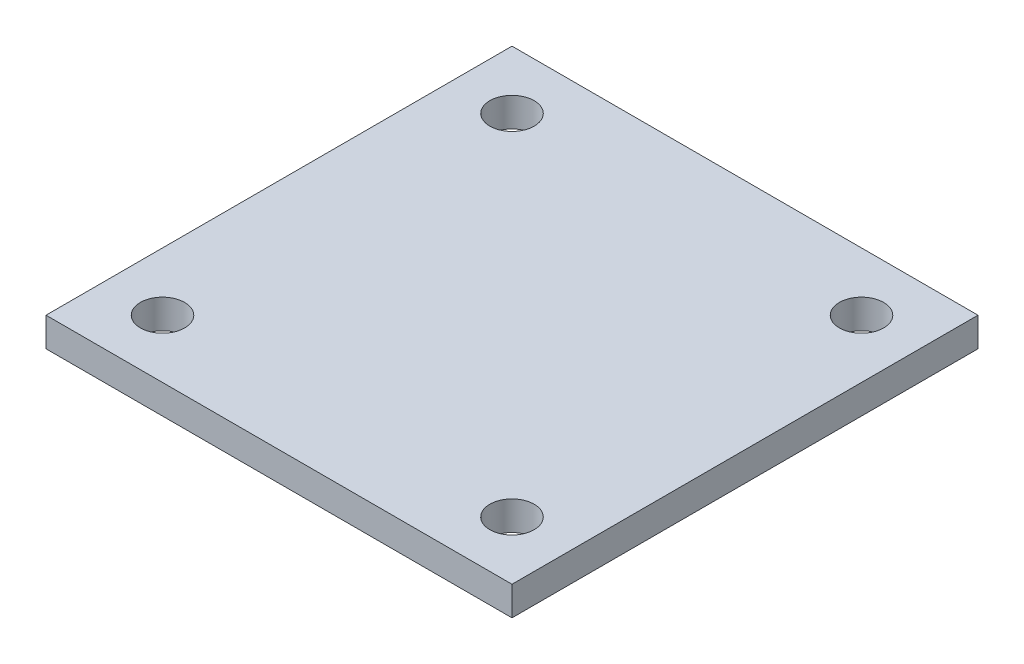
ISO-10303-21;
HEADER;
FILE_DESCRIPTION(('STEP AP214'),'2;1');
FILE_NAME('part.step','',(''),(''),'','','');
FILE_SCHEMA(('AUTOMOTIVE_DESIGN { 1 0 10303 214 1 1 1 1 }'));
ENDSEC;
DATA;
#1=APPLICATION_CONTEXT('core data for automotive mechanical design processes');
#2=APPLICATION_PROTOCOL_DEFINITION('international standard','automotive_design',2000,#1);
#3=PRODUCT_CONTEXT('',#1,'mechanical');
#4=PRODUCT('Part','Part','',(#3));
#5=PRODUCT_RELATED_PRODUCT_CATEGORY('part','',(#4));
#6=PRODUCT_DEFINITION_FORMATION('','',#4);
#7=PRODUCT_DEFINITION_CONTEXT('part definition',#1,'design');
#8=PRODUCT_DEFINITION('design','',#6,#7);
#9=PRODUCT_DEFINITION_SHAPE('','',#8);
#10=(LENGTH_UNIT() NAMED_UNIT(*) SI_UNIT(.MILLI.,.METRE.));
#11=(NAMED_UNIT(*) PLANE_ANGLE_UNIT() SI_UNIT($,.RADIAN.));
#12=(NAMED_UNIT(*) SI_UNIT($,.STERADIAN.) SOLID_ANGLE_UNIT());
#13=UNCERTAINTY_MEASURE_WITH_UNIT(LENGTH_MEASURE(1.E-05),#10,'distance_accuracy_value','');
#14=(GEOMETRIC_REPRESENTATION_CONTEXT(3) GLOBAL_UNCERTAINTY_ASSIGNED_CONTEXT((#13)) GLOBAL_UNIT_ASSIGNED_CONTEXT((#10,
#11,#12)) REPRESENTATION_CONTEXT('',''));
#15=CARTESIAN_POINT('',(0.,0.,0.));
#16=DIRECTION('',(0.,0.,1.));
#17=DIRECTION('',(1.,0.,0.));
#18=AXIS2_PLACEMENT_3D('',#15,#16,#17);
#19=CARTESIAN_POINT('',(-50.8,6.35,-50.8));
#20=DIRECTION('',(1.,0.,0.));
#21=DIRECTION('',(0.,0.,-1.));
#22=AXIS2_PLACEMENT_3D('',#19,#20,#21);
#23=PLANE('',#22);
#24=DIRECTION('',(0.,0.,1.));
#25=VECTOR('',#24,1.);
#26=CARTESIAN_POINT('',(-50.8,0.,-50.8));
#27=LINE('',#26,#25);
#28=CARTESIAN_POINT('',(-50.8,0.,-50.8));
#29=VERTEX_POINT('',#28);
#30=CARTESIAN_POINT('',(-50.8,0.,50.8));
#31=VERTEX_POINT('',#30);
#32=EDGE_CURVE('E107',#29,#31,#27,.T.);
#33=ORIENTED_EDGE('',*,*,#32,.T.);
#34=DIRECTION('',(0.,-1.,0.));
#35=VECTOR('',#34,1.);
#36=CARTESIAN_POINT('',(-50.8,6.35,50.8));
#37=LINE('',#36,#35);
#38=CARTESIAN_POINT('',(-50.8,6.35,50.8));
#39=VERTEX_POINT('',#38);
#40=EDGE_CURVE('E11',#39,#31,#37,.T.);
#41=ORIENTED_EDGE('',*,*,#40,.F.);
#42=DIRECTION('',(0.,0.,1.));
#43=VECTOR('',#42,1.);
#44=CARTESIAN_POINT('',(-50.8,6.35,-50.8));
#45=LINE('',#44,#43);
#46=CARTESIAN_POINT('',(-50.8,6.35,-50.8));
#47=VERTEX_POINT('',#46);
#48=EDGE_CURVE('E91',#47,#39,#45,.T.);
#49=ORIENTED_EDGE('',*,*,#48,.F.);
#50=DIRECTION('',(0.,-1.,0.));
#51=VECTOR('',#50,1.);
#52=CARTESIAN_POINT('',(-50.8,6.35,-50.8));
#53=LINE('',#52,#51);
#54=EDGE_CURVE('E103',#47,#29,#53,.T.);
#55=ORIENTED_EDGE('',*,*,#54,.T.);
#56=EDGE_LOOP('',(#33,#41,#49,#55));
#57=FACE_BOUND('',#56,.T.);
#58=ADVANCED_FACE('F39',(#57),#23,.F.);
#59=CARTESIAN_POINT('',(50.8,6.35,50.8));
#60=DIRECTION('',(0.,0.,-1.));
#61=DIRECTION('',(-1.,0.,0.));
#62=AXIS2_PLACEMENT_3D('',#59,#60,#61);
#63=PLANE('',#62);
#64=DIRECTION('',(1.,0.,0.));
#65=VECTOR('',#64,1.);
#66=CARTESIAN_POINT('',(50.8,0.,50.8));
#67=LINE('',#66,#65);
#68=CARTESIAN_POINT('',(50.8,0.,50.8));
#69=VERTEX_POINT('',#68);
#70=EDGE_CURVE('E96',#31,#69,#67,.T.);
#71=ORIENTED_EDGE('',*,*,#70,.T.);
#72=DIRECTION('',(0.,-1.,0.));
#73=VECTOR('',#72,1.);
#74=CARTESIAN_POINT('',(50.8,6.35,50.8));
#75=LINE('',#74,#73);
#76=CARTESIAN_POINT('',(50.8,6.35,50.8));
#77=VERTEX_POINT('',#76);
#78=EDGE_CURVE('E48',#77,#69,#75,.T.);
#79=ORIENTED_EDGE('',*,*,#78,.F.);
#80=DIRECTION('',(1.,0.,0.));
#81=VECTOR('',#80,1.);
#82=CARTESIAN_POINT('',(50.8,6.35,50.8));
#83=LINE('',#82,#81);
#84=EDGE_CURVE('E86',#39,#77,#83,.T.);
#85=ORIENTED_EDGE('',*,*,#84,.F.);
#86=ORIENTED_EDGE('',*,*,#40,.T.);
#87=EDGE_LOOP('',(#71,#79,#85,#86));
#88=FACE_BOUND('',#87,.T.);
#89=ADVANCED_FACE('F95',(#88),#63,.F.);
#90=CARTESIAN_POINT('',(50.8,6.35,-50.8));
#91=DIRECTION('',(-1.,0.,0.));
#92=DIRECTION('',(0.,0.,1.));
#93=AXIS2_PLACEMENT_3D('',#90,#91,#92);
#94=PLANE('',#93);
#95=DIRECTION('',(0.,0.,-1.));
#96=VECTOR('',#95,1.);
#97=CARTESIAN_POINT('',(50.8,0.,-50.8));
#98=LINE('',#97,#96);
#99=CARTESIAN_POINT('',(50.8,0.,-50.8));
#100=VERTEX_POINT('',#99);
#101=EDGE_CURVE('E73',#69,#100,#98,.T.);
#102=ORIENTED_EDGE('',*,*,#101,.T.);
#103=DIRECTION('',(0.,-1.,0.));
#104=VECTOR('',#103,1.);
#105=CARTESIAN_POINT('',(50.8,6.35,-50.8));
#106=LINE('',#105,#104);
#107=CARTESIAN_POINT('',(50.8,6.35,-50.8));
#108=VERTEX_POINT('',#107);
#109=EDGE_CURVE('E98',#108,#100,#106,.T.);
#110=ORIENTED_EDGE('',*,*,#109,.F.);
#111=DIRECTION('',(0.,0.,-1.));
#112=VECTOR('',#111,1.);
#113=CARTESIAN_POINT('',(50.8,6.35,-50.8));
#114=LINE('',#113,#112);
#115=EDGE_CURVE('E89',#77,#108,#114,.T.);
#116=ORIENTED_EDGE('',*,*,#115,.F.);
#117=ORIENTED_EDGE('',*,*,#78,.T.);
#118=EDGE_LOOP('',(#102,#110,#116,#117));
#119=FACE_BOUND('',#118,.T.);
#120=ADVANCED_FACE('F99',(#119),#94,.F.);
#121=CARTESIAN_POINT('',(50.8,6.35,-50.8));
#122=DIRECTION('',(0.,0.,1.));
#123=DIRECTION('',(1.,0.,0.));
#124=AXIS2_PLACEMENT_3D('',#121,#122,#123);
#125=PLANE('',#124);
#126=DIRECTION('',(-1.,0.,0.));
#127=VECTOR('',#126,1.);
#128=CARTESIAN_POINT('',(50.8,0.,-50.8));
#129=LINE('',#128,#127);
#130=EDGE_CURVE('E79',#100,#29,#129,.T.);
#131=ORIENTED_EDGE('',*,*,#130,.T.);
#132=ORIENTED_EDGE('',*,*,#54,.F.);
#133=DIRECTION('',(-1.,0.,0.));
#134=VECTOR('',#133,1.);
#135=CARTESIAN_POINT('',(50.8,6.35,-50.8));
#136=LINE('',#135,#134);
#137=EDGE_CURVE('E56',#108,#47,#136,.T.);
#138=ORIENTED_EDGE('',*,*,#137,.F.);
#139=ORIENTED_EDGE('',*,*,#109,.T.);
#140=EDGE_LOOP('',(#131,#132,#138,#139));
#141=FACE_BOUND('',#140,.T.);
#142=ADVANCED_FACE('F121',(#141),#125,.F.);
#143=CARTESIAN_POINT('',(0.,6.35,0.));
#144=DIRECTION('',(0.,-1.,0.));
#145=DIRECTION('',(0.,0.,-1.));
#146=AXIS2_PLACEMENT_3D('',#143,#144,#145);
#147=PLANE('',#146);
#148=CARTESIAN_POINT('',(-38.1,6.35,38.1));
#149=DIRECTION('',(0.,1.,0.));
#150=DIRECTION('',(0.,0.,1.));
#151=AXIS2_PLACEMENT_3D('',#148,#149,#150);
#152=CIRCLE('',#151,4.826);
#153=CARTESIAN_POINT('',(-38.1,6.35,42.926));
#154=VERTEX_POINT('',#153);
#155=EDGE_CURVE('E136',#154,#154,#152,.T.);
#156=ORIENTED_EDGE('',*,*,#155,.F.);
#157=EDGE_LOOP('',(#156));
#158=FACE_BOUND('',#157,.T.);
#159=CARTESIAN_POINT('',(38.1,6.35,38.1));
#160=DIRECTION('',(0.,1.,0.));
#161=DIRECTION('',(0.,0.,1.));
#162=AXIS2_PLACEMENT_3D('',#159,#160,#161);
#163=CIRCLE('',#162,4.826);
#164=CARTESIAN_POINT('',(38.1,6.35,42.926));
#165=VERTEX_POINT('',#164);
#166=EDGE_CURVE('E144',#165,#165,#163,.T.);
#167=ORIENTED_EDGE('',*,*,#166,.F.);
#168=EDGE_LOOP('',(#167));
#169=FACE_BOUND('',#168,.T.);
#170=CARTESIAN_POINT('',(38.1,6.35,-38.1));
#171=DIRECTION('',(0.,1.,0.));
#172=DIRECTION('',(0.,0.,1.));
#173=AXIS2_PLACEMENT_3D('',#170,#171,#172);
#174=CIRCLE('',#173,4.826);
#175=CARTESIAN_POINT('',(38.1,6.35,-33.274));
#176=VERTEX_POINT('',#175);
#177=EDGE_CURVE('E152',#176,#176,#174,.T.);
#178=ORIENTED_EDGE('',*,*,#177,.F.);
#179=EDGE_LOOP('',(#178));
#180=FACE_BOUND('',#179,.T.);
#181=CARTESIAN_POINT('',(-38.1,6.35,-38.1));
#182=DIRECTION('',(0.,1.,0.));
#183=DIRECTION('',(0.,0.,1.));
#184=AXIS2_PLACEMENT_3D('',#181,#182,#183);
#185=CIRCLE('',#184,4.826);
#186=CARTESIAN_POINT('',(-38.1,6.35,-33.274));
#187=VERTEX_POINT('',#186);
#188=EDGE_CURVE('E128',#187,#187,#185,.T.);
#189=ORIENTED_EDGE('',*,*,#188,.F.);
#190=EDGE_LOOP('',(#189));
#191=FACE_BOUND('',#190,.T.);
#192=ORIENTED_EDGE('',*,*,#48,.T.);
#193=ORIENTED_EDGE('',*,*,#84,.T.);
#194=ORIENTED_EDGE('',*,*,#115,.T.);
#195=ORIENTED_EDGE('',*,*,#137,.T.);
#196=EDGE_LOOP('',(#192,#193,#194,#195));
#197=FACE_BOUND('',#196,.T.);
#198=ADVANCED_FACE('F87',(#158,#169,#180,#191,#197),#147,.F.);
#199=CARTESIAN_POINT('',(0.,0.,0.));
#200=DIRECTION('',(0.,-1.,0.));
#201=DIRECTION('',(0.,0.,-1.));
#202=AXIS2_PLACEMENT_3D('',#199,#200,#201);
#203=PLANE('',#202);
#204=CARTESIAN_POINT('',(-38.1,0.,38.1));
#205=DIRECTION('',(0.,1.,0.));
#206=DIRECTION('',(0.,0.,1.));
#207=AXIS2_PLACEMENT_3D('',#204,#205,#206);
#208=CIRCLE('',#207,4.826);
#209=CARTESIAN_POINT('',(-38.1,0.,42.926));
#210=VERTEX_POINT('',#209);
#211=EDGE_CURVE('E140',#210,#210,#208,.T.);
#212=ORIENTED_EDGE('',*,*,#211,.T.);
#213=EDGE_LOOP('',(#212));
#214=FACE_BOUND('',#213,.T.);
#215=CARTESIAN_POINT('',(38.1,0.,38.1));
#216=DIRECTION('',(0.,1.,0.));
#217=DIRECTION('',(0.,0.,1.));
#218=AXIS2_PLACEMENT_3D('',#215,#216,#217);
#219=CIRCLE('',#218,4.826);
#220=CARTESIAN_POINT('',(38.1,0.,42.926));
#221=VERTEX_POINT('',#220);
#222=EDGE_CURVE('E148',#221,#221,#219,.T.);
#223=ORIENTED_EDGE('',*,*,#222,.T.);
#224=EDGE_LOOP('',(#223));
#225=FACE_BOUND('',#224,.T.);
#226=CARTESIAN_POINT('',(38.1,0.,-38.1));
#227=DIRECTION('',(0.,1.,0.));
#228=DIRECTION('',(0.,0.,1.));
#229=AXIS2_PLACEMENT_3D('',#226,#227,#228);
#230=CIRCLE('',#229,4.826);
#231=CARTESIAN_POINT('',(38.1,0.,-33.274));
#232=VERTEX_POINT('',#231);
#233=EDGE_CURVE('E132',#232,#232,#230,.T.);
#234=ORIENTED_EDGE('',*,*,#233,.T.);
#235=EDGE_LOOP('',(#234));
#236=FACE_BOUND('',#235,.T.);
#237=CARTESIAN_POINT('',(-38.1,0.,-38.1));
#238=DIRECTION('',(0.,1.,0.));
#239=DIRECTION('',(0.,0.,1.));
#240=AXIS2_PLACEMENT_3D('',#237,#238,#239);
#241=CIRCLE('',#240,4.826);
#242=CARTESIAN_POINT('',(-38.1,0.,-33.274));
#243=VERTEX_POINT('',#242);
#244=EDGE_CURVE('E111',#243,#243,#241,.T.);
#245=ORIENTED_EDGE('',*,*,#244,.T.);
#246=EDGE_LOOP('',(#245));
#247=FACE_BOUND('',#246,.T.);
#248=ORIENTED_EDGE('',*,*,#32,.F.);
#249=ORIENTED_EDGE('',*,*,#130,.F.);
#250=ORIENTED_EDGE('',*,*,#101,.F.);
#251=ORIENTED_EDGE('',*,*,#70,.F.);
#252=EDGE_LOOP('',(#248,#249,#250,#251));
#253=FACE_BOUND('',#252,.T.);
#254=ADVANCED_FACE('F124',(#214,#225,#236,#247,#253),#203,.T.);
#255=CARTESIAN_POINT('',(-38.1,0.,-38.1));
#256=DIRECTION('',(0.,1.,0.));
#257=DIRECTION('',(0.,0.,1.));
#258=AXIS2_PLACEMENT_3D('',#255,#256,#257);
#259=CYLINDRICAL_SURFACE('',#258,4.826);
#260=ORIENTED_EDGE('',*,*,#244,.F.);
#261=EDGE_LOOP('',(#260));
#262=FACE_BOUND('',#261,.T.);
#263=ORIENTED_EDGE('',*,*,#188,.T.);
#264=EDGE_LOOP('',(#263));
#265=FACE_BOUND('',#264,.T.);
#266=ADVANCED_FACE('F166',(#262,#265),#259,.F.);
#267=CARTESIAN_POINT('',(38.1,0.,-38.1));
#268=DIRECTION('',(0.,1.,0.));
#269=DIRECTION('',(0.,0.,1.));
#270=AXIS2_PLACEMENT_3D('',#267,#268,#269);
#271=CYLINDRICAL_SURFACE('',#270,4.826);
#272=ORIENTED_EDGE('',*,*,#233,.F.);
#273=EDGE_LOOP('',(#272));
#274=FACE_BOUND('',#273,.T.);
#275=ORIENTED_EDGE('',*,*,#177,.T.);
#276=EDGE_LOOP('',(#275));
#277=FACE_BOUND('',#276,.T.);
#278=ADVANCED_FACE('F162',(#274,#277),#271,.F.);
#279=CARTESIAN_POINT('',(38.1,0.,38.1));
#280=DIRECTION('',(0.,1.,0.));
#281=DIRECTION('',(0.,0.,1.));
#282=AXIS2_PLACEMENT_3D('',#279,#280,#281);
#283=CYLINDRICAL_SURFACE('',#282,4.826);
#284=ORIENTED_EDGE('',*,*,#222,.F.);
#285=EDGE_LOOP('',(#284));
#286=FACE_BOUND('',#285,.T.);
#287=ORIENTED_EDGE('',*,*,#166,.T.);
#288=EDGE_LOOP('',(#287));
#289=FACE_BOUND('',#288,.T.);
#290=ADVANCED_FACE('F165',(#286,#289),#283,.F.);
#291=CARTESIAN_POINT('',(-38.1,0.,38.1));
#292=DIRECTION('',(0.,1.,0.));
#293=DIRECTION('',(0.,0.,1.));
#294=AXIS2_PLACEMENT_3D('',#291,#292,#293);
#295=CYLINDRICAL_SURFACE('',#294,4.826);
#296=ORIENTED_EDGE('',*,*,#211,.F.);
#297=EDGE_LOOP('',(#296));
#298=FACE_BOUND('',#297,.T.);
#299=ORIENTED_EDGE('',*,*,#155,.T.);
#300=EDGE_LOOP('',(#299));
#301=FACE_BOUND('',#300,.T.);
#302=ADVANCED_FACE('F227',(#298,#301),#295,.F.);
#303=CLOSED_SHELL('',(#58,#89,#120,#142,#198,#254,#266,#278,#290,#302));
#304=MANIFOLD_SOLID_BREP('B2',#303);
#305=ADVANCED_BREP_SHAPE_REPRESENTATION('',(#18,#304),#14);
#306=SHAPE_DEFINITION_REPRESENTATION(#9,#305);
ENDSEC;
END-ISO-10303-21;
